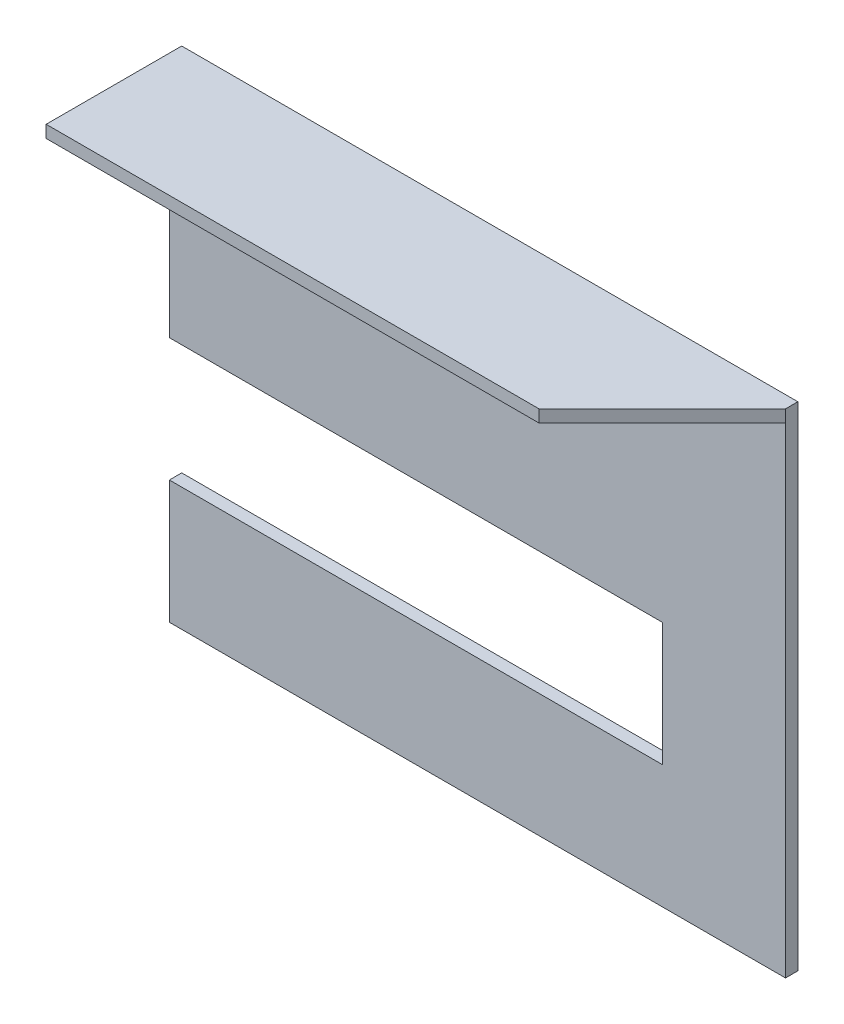
ISO-10303-21;
HEADER;
FILE_DESCRIPTION(('STEP AP214'),'2;1');
FILE_NAME('part.step','',(''),(''),'','','');
FILE_SCHEMA(('AUTOMOTIVE_DESIGN { 1 0 10303 214 1 1 1 1 }'));
ENDSEC;
DATA;
#1=APPLICATION_CONTEXT('core data for automotive mechanical design processes');
#2=APPLICATION_PROTOCOL_DEFINITION('international standard','automotive_design',2000,#1);
#3=PRODUCT_CONTEXT('',#1,'mechanical');
#4=PRODUCT('Part','Part','',(#3));
#5=PRODUCT_RELATED_PRODUCT_CATEGORY('part','',(#4));
#6=PRODUCT_DEFINITION_FORMATION('','',#4);
#7=PRODUCT_DEFINITION_CONTEXT('part definition',#1,'design');
#8=PRODUCT_DEFINITION('design','',#6,#7);
#9=PRODUCT_DEFINITION_SHAPE('','',#8);
#10=(LENGTH_UNIT() NAMED_UNIT(*) SI_UNIT(.MILLI.,.METRE.));
#11=(NAMED_UNIT(*) PLANE_ANGLE_UNIT() SI_UNIT($,.RADIAN.));
#12=(NAMED_UNIT(*) SI_UNIT($,.STERADIAN.) SOLID_ANGLE_UNIT());
#13=UNCERTAINTY_MEASURE_WITH_UNIT(LENGTH_MEASURE(1.E-05),#10,'distance_accuracy_value','');
#14=(GEOMETRIC_REPRESENTATION_CONTEXT(3) GLOBAL_UNCERTAINTY_ASSIGNED_CONTEXT((#13)) GLOBAL_UNIT_ASSIGNED_CONTEXT((#10,
#11,#12)) REPRESENTATION_CONTEXT('',''));
#15=CARTESIAN_POINT('',(0.,0.,0.));
#16=DIRECTION('',(0.,0.,1.));
#17=DIRECTION('',(1.,0.,0.));
#18=AXIS2_PLACEMENT_3D('',#15,#16,#17);
#19=CARTESIAN_POINT('',(-26.5032099718416,9.39871601126336,1.));
#20=DIRECTION('',(0.,-1.,0.));
#21=DIRECTION('',(1.,0.,0.));
#22=AXIS2_PLACEMENT_3D('',#19,#20,#21);
#23=PLANE('',#22);
#24=DIRECTION('',(-1.,0.,0.));
#25=VECTOR('',#24,1.);
#26=CARTESIAN_POINT('',(-26.5032099718416,9.39871601126336,11.));
#27=LINE('',#26,#25);
#28=CARTESIAN_POINT('',(13.4967900281584,9.39871601126336,11.));
#29=VERTEX_POINT('',#28);
#30=CARTESIAN_POINT('',(-26.5032099718416,9.39871601126336,11.));
#31=VERTEX_POINT('',#30);
#32=EDGE_CURVE('E123',#29,#31,#27,.T.);
#33=ORIENTED_EDGE('',*,*,#32,.F.);
#34=DIRECTION('',(-0.707106781186546,0.,0.707106781186549));
#35=VECTOR('',#34,1.);
#36=CARTESIAN_POINT('',(13.4967900281584,9.39871601126336,11.));
#37=LINE('',#36,#35);
#38=CARTESIAN_POINT('',(23.4967900281584,9.39871601126335,0.999999999999978));
#39=VERTEX_POINT('',#38);
#40=EDGE_CURVE('E51',#29,#39,#37,.F.);
#41=ORIENTED_EDGE('',*,*,#40,.T.);
#42=DIRECTION('',(0.,0.,-1.));
#43=VECTOR('',#42,1.);
#44=CARTESIAN_POINT('',(23.4967900281584,9.39871601126335,1.));
#45=LINE('',#44,#43);
#46=CARTESIAN_POINT('',(23.4967900281584,9.39871601126335,0.));
#47=VERTEX_POINT('',#46);
#48=EDGE_CURVE('E150',#39,#47,#45,.T.);
#49=ORIENTED_EDGE('',*,*,#48,.T.);
#50=DIRECTION('',(-1.,0.,0.));
#51=VECTOR('',#50,1.);
#52=CARTESIAN_POINT('',(-26.5032099718416,9.39871601126336,0.));
#53=LINE('',#52,#51);
#54=CARTESIAN_POINT('',(-26.5032099718416,9.39871601126336,0.));
#55=VERTEX_POINT('',#54);
#56=EDGE_CURVE('E137',#47,#55,#53,.T.);
#57=ORIENTED_EDGE('',*,*,#56,.T.);
#58=DIRECTION('',(0.,0.,-1.));
#59=VECTOR('',#58,1.);
#60=CARTESIAN_POINT('',(-26.5032099718416,9.39871601126336,1.));
#61=LINE('',#60,#59);
#62=EDGE_CURVE('E168',#31,#55,#61,.T.);
#63=ORIENTED_EDGE('',*,*,#62,.F.);
#64=EDGE_LOOP('',(#33,#41,#49,#57,#63));
#65=FACE_BOUND('',#64,.T.);
#66=ADVANCED_FACE('F35',(#65),#23,.F.);
#67=CARTESIAN_POINT('',(-26.5032099718416,9.39871601126336,1.));
#68=DIRECTION('',(1.,0.,0.));
#69=DIRECTION('',(0.,1.,0.));
#70=AXIS2_PLACEMENT_3D('',#67,#68,#69);
#71=PLANE('',#70);
#72=DIRECTION('',(0.,-1.,0.));
#73=VECTOR('',#72,1.);
#74=CARTESIAN_POINT('',(-26.5032099718416,9.39871601126336,0.));
#75=LINE('',#74,#73);
#76=CARTESIAN_POINT('',(-26.5032099718416,-10.6012839887366,0.));
#77=VERTEX_POINT('',#76);
#78=EDGE_CURVE('E139',#55,#77,#75,.T.);
#79=ORIENTED_EDGE('',*,*,#78,.T.);
#80=DIRECTION('',(0.,0.,-1.));
#81=VECTOR('',#80,1.);
#82=CARTESIAN_POINT('',(-26.5032099718416,-10.6012839887366,1.));
#83=LINE('',#82,#81);
#84=CARTESIAN_POINT('',(-26.5032099718416,-10.6012839887366,1.));
#85=VERTEX_POINT('',#84);
#86=EDGE_CURVE('E171',#85,#77,#83,.T.);
#87=ORIENTED_EDGE('',*,*,#86,.F.);
#88=DIRECTION('',(0.,-1.,0.));
#89=VECTOR('',#88,1.);
#90=CARTESIAN_POINT('',(-26.5032099718416,9.39871601126336,1.));
#91=LINE('',#90,#89);
#92=CARTESIAN_POINT('',(-26.5032099718416,8.39871601126335,1.));
#93=VERTEX_POINT('',#92);
#94=EDGE_CURVE('E136',#93,#85,#91,.T.);
#95=ORIENTED_EDGE('',*,*,#94,.F.);
#96=DIRECTION('',(0.,0.,-1.));
#97=VECTOR('',#96,1.);
#98=CARTESIAN_POINT('',(-26.5032099718416,8.39871601126335,11.));
#99=LINE('',#98,#97);
#100=CARTESIAN_POINT('',(-26.5032099718416,8.39871601126335,11.));
#101=VERTEX_POINT('',#100);
#102=EDGE_CURVE('E120',#101,#93,#99,.T.);
#103=ORIENTED_EDGE('',*,*,#102,.F.);
#104=DIRECTION('',(0.,-1.,0.));
#105=VECTOR('',#104,1.);
#106=CARTESIAN_POINT('',(-26.5032099718416,8.39871601126335,11.));
#107=LINE('',#106,#105);
#108=EDGE_CURVE('E124',#31,#101,#107,.T.);
#109=ORIENTED_EDGE('',*,*,#108,.F.);
#110=ORIENTED_EDGE('',*,*,#62,.T.);
#111=EDGE_LOOP('',(#79,#87,#95,#103,#109,#110));
#112=FACE_BOUND('',#111,.T.);
#113=ADVANCED_FACE('F134',(#112),#71,.F.);
#114=CARTESIAN_POINT('',(-26.5032099718416,-10.6012839887366,1.));
#115=DIRECTION('',(0.,1.,0.));
#116=DIRECTION('',(0.,0.,1.));
#117=AXIS2_PLACEMENT_3D('',#114,#115,#116);
#118=PLANE('',#117);
#119=DIRECTION('',(1.,0.,0.));
#120=VECTOR('',#119,1.);
#121=CARTESIAN_POINT('',(-26.5032099718416,-10.6012839887366,0.));
#122=LINE('',#121,#120);
#123=CARTESIAN_POINT('',(13.4967900281584,-10.6012839887366,0.));
#124=VERTEX_POINT('',#123);
#125=EDGE_CURVE('E195',#77,#124,#122,.T.);
#126=ORIENTED_EDGE('',*,*,#125,.T.);
#127=DIRECTION('',(0.,0.,-1.));
#128=VECTOR('',#127,1.);
#129=CARTESIAN_POINT('',(13.4967900281584,-10.6012839887366,1.));
#130=LINE('',#129,#128);
#131=CARTESIAN_POINT('',(13.4967900281584,-10.6012839887366,1.));
#132=VERTEX_POINT('',#131);
#133=EDGE_CURVE('E175',#132,#124,#130,.T.);
#134=ORIENTED_EDGE('',*,*,#133,.F.);
#135=DIRECTION('',(1.,0.,0.));
#136=VECTOR('',#135,1.);
#137=CARTESIAN_POINT('',(-26.5032099718416,-10.6012839887366,1.));
#138=LINE('',#137,#136);
#139=EDGE_CURVE('E184',#85,#132,#138,.T.);
#140=ORIENTED_EDGE('',*,*,#139,.F.);
#141=ORIENTED_EDGE('',*,*,#86,.T.);
#142=EDGE_LOOP('',(#126,#134,#140,#141));
#143=FACE_BOUND('',#142,.T.);
#144=ADVANCED_FACE('F239',(#143),#118,.F.);
#145=CARTESIAN_POINT('',(13.4967900281584,-10.6012839887366,1.));
#146=DIRECTION('',(1.,0.,0.));
#147=DIRECTION('',(0.,1.,0.));
#148=AXIS2_PLACEMENT_3D('',#145,#146,#147);
#149=PLANE('',#148);
#150=DIRECTION('',(0.,-1.,0.));
#151=VECTOR('',#150,1.);
#152=CARTESIAN_POINT('',(13.4967900281584,-10.6012839887366,0.));
#153=LINE('',#152,#151);
#154=CARTESIAN_POINT('',(13.4967900281584,-20.6012839887366,0.));
#155=VERTEX_POINT('',#154);
#156=EDGE_CURVE('E197',#124,#155,#153,.T.);
#157=ORIENTED_EDGE('',*,*,#156,.T.);
#158=DIRECTION('',(0.,0.,-1.));
#159=VECTOR('',#158,1.);
#160=CARTESIAN_POINT('',(13.4967900281584,-20.6012839887366,1.));
#161=LINE('',#160,#159);
#162=CARTESIAN_POINT('',(13.4967900281584,-20.6012839887366,1.));
#163=VERTEX_POINT('',#162);
#164=EDGE_CURVE('E214',#163,#155,#161,.T.);
#165=ORIENTED_EDGE('',*,*,#164,.F.);
#166=DIRECTION('',(0.,-1.,0.));
#167=VECTOR('',#166,1.);
#168=CARTESIAN_POINT('',(13.4967900281584,-10.6012839887366,1.));
#169=LINE('',#168,#167);
#170=EDGE_CURVE('E186',#132,#163,#169,.T.);
#171=ORIENTED_EDGE('',*,*,#170,.F.);
#172=ORIENTED_EDGE('',*,*,#133,.T.);
#173=EDGE_LOOP('',(#157,#165,#171,#172));
#174=FACE_BOUND('',#173,.T.);
#175=ADVANCED_FACE('F221',(#174),#149,.F.);
#176=CARTESIAN_POINT('',(13.4967900281584,-20.6012839887366,1.));
#177=DIRECTION('',(0.,-1.,0.));
#178=DIRECTION('',(1.,0.,0.));
#179=AXIS2_PLACEMENT_3D('',#176,#177,#178);
#180=PLANE('',#179);
#181=DIRECTION('',(-1.,0.,0.));
#182=VECTOR('',#181,1.);
#183=CARTESIAN_POINT('',(13.4967900281584,-20.6012839887366,0.));
#184=LINE('',#183,#182);
#185=CARTESIAN_POINT('',(-26.5032099718416,-20.6012839887366,0.));
#186=VERTEX_POINT('',#185);
#187=EDGE_CURVE('E199',#155,#186,#184,.T.);
#188=ORIENTED_EDGE('',*,*,#187,.T.);
#189=DIRECTION('',(0.,0.,-1.));
#190=VECTOR('',#189,1.);
#191=CARTESIAN_POINT('',(-26.5032099718416,-20.6012839887366,1.));
#192=LINE('',#191,#190);
#193=CARTESIAN_POINT('',(-26.5032099718416,-20.6012839887366,1.));
#194=VERTEX_POINT('',#193);
#195=EDGE_CURVE('E211',#194,#186,#192,.T.);
#196=ORIENTED_EDGE('',*,*,#195,.F.);
#197=DIRECTION('',(-1.,0.,0.));
#198=VECTOR('',#197,1.);
#199=CARTESIAN_POINT('',(13.4967900281584,-20.6012839887366,1.));
#200=LINE('',#199,#198);
#201=EDGE_CURVE('E188',#163,#194,#200,.T.);
#202=ORIENTED_EDGE('',*,*,#201,.F.);
#203=ORIENTED_EDGE('',*,*,#164,.T.);
#204=EDGE_LOOP('',(#188,#196,#202,#203));
#205=FACE_BOUND('',#204,.T.);
#206=ADVANCED_FACE('F233',(#205),#180,.F.);
#207=CARTESIAN_POINT('',(-26.5032099718416,-20.6012839887366,1.));
#208=DIRECTION('',(1.,0.,0.));
#209=DIRECTION('',(0.,0.,-1.));
#210=AXIS2_PLACEMENT_3D('',#207,#208,#209);
#211=PLANE('',#210);
#212=DIRECTION('',(0.,-1.,0.));
#213=VECTOR('',#212,1.);
#214=CARTESIAN_POINT('',(-26.5032099718416,-20.6012839887366,0.));
#215=LINE('',#214,#213);
#216=CARTESIAN_POINT('',(-26.5032099718416,-30.6012839887366,0.));
#217=VERTEX_POINT('',#216);
#218=EDGE_CURVE('E201',#186,#217,#215,.T.);
#219=ORIENTED_EDGE('',*,*,#218,.T.);
#220=DIRECTION('',(0.,0.,-1.));
#221=VECTOR('',#220,1.);
#222=CARTESIAN_POINT('',(-26.5032099718416,-30.6012839887366,1.));
#223=LINE('',#222,#221);
#224=CARTESIAN_POINT('',(-26.5032099718416,-30.6012839887366,1.));
#225=VERTEX_POINT('',#224);
#226=EDGE_CURVE('E208',#225,#217,#223,.T.);
#227=ORIENTED_EDGE('',*,*,#226,.F.);
#228=DIRECTION('',(0.,-1.,0.));
#229=VECTOR('',#228,1.);
#230=CARTESIAN_POINT('',(-26.5032099718416,-20.6012839887366,1.));
#231=LINE('',#230,#229);
#232=EDGE_CURVE('E190',#194,#225,#231,.T.);
#233=ORIENTED_EDGE('',*,*,#232,.F.);
#234=ORIENTED_EDGE('',*,*,#195,.T.);
#235=EDGE_LOOP('',(#219,#227,#233,#234));
#236=FACE_BOUND('',#235,.T.);
#237=ADVANCED_FACE('F237',(#236),#211,.F.);
#238=CARTESIAN_POINT('',(-26.5032099718416,-30.6012839887366,1.));
#239=DIRECTION('',(0.,1.,0.));
#240=DIRECTION('',(0.,0.,1.));
#241=AXIS2_PLACEMENT_3D('',#238,#239,#240);
#242=PLANE('',#241);
#243=DIRECTION('',(1.,0.,0.));
#244=VECTOR('',#243,1.);
#245=CARTESIAN_POINT('',(-26.5032099718416,-30.6012839887366,0.));
#246=LINE('',#245,#244);
#247=CARTESIAN_POINT('',(23.4967900281584,-30.6012839887366,0.));
#248=VERTEX_POINT('',#247);
#249=EDGE_CURVE('E203',#217,#248,#246,.T.);
#250=ORIENTED_EDGE('',*,*,#249,.T.);
#251=DIRECTION('',(0.,0.,-1.));
#252=VECTOR('',#251,1.);
#253=CARTESIAN_POINT('',(23.4967900281584,-30.6012839887366,1.));
#254=LINE('',#253,#252);
#255=CARTESIAN_POINT('',(23.4967900281584,-30.6012839887366,1.));
#256=VERTEX_POINT('',#255);
#257=EDGE_CURVE('E192',#256,#248,#254,.T.);
#258=ORIENTED_EDGE('',*,*,#257,.F.);
#259=DIRECTION('',(1.,0.,0.));
#260=VECTOR('',#259,1.);
#261=CARTESIAN_POINT('',(-26.5032099718416,-30.6012839887366,1.));
#262=LINE('',#261,#260);
#263=EDGE_CURVE('E164',#225,#256,#262,.T.);
#264=ORIENTED_EDGE('',*,*,#263,.F.);
#265=ORIENTED_EDGE('',*,*,#226,.T.);
#266=EDGE_LOOP('',(#250,#258,#264,#265));
#267=FACE_BOUND('',#266,.T.);
#268=ADVANCED_FACE('F241',(#267),#242,.F.);
#269=CARTESIAN_POINT('',(23.4967900281584,-8.33256261734247,1.));
#270=DIRECTION('',(-1.,0.,0.));
#271=DIRECTION('',(0.,-1.,0.));
#272=AXIS2_PLACEMENT_3D('',#269,#270,#271);
#273=PLANE('',#272);
#274=ORIENTED_EDGE('',*,*,#48,.F.);
#275=DIRECTION('',(0.,-1.,0.));
#276=VECTOR('',#275,1.);
#277=CARTESIAN_POINT('',(23.4967900281584,-8.33256261734247,0.999999999999978));
#278=LINE('',#277,#276);
#279=CARTESIAN_POINT('',(23.4967900281584,8.39871601126335,1.));
#280=VERTEX_POINT('',#279);
#281=EDGE_CURVE('E44',#39,#280,#278,.T.);
#282=ORIENTED_EDGE('',*,*,#281,.T.);
#283=DIRECTION('',(0.,1.,0.));
#284=VECTOR('',#283,1.);
#285=CARTESIAN_POINT('',(23.4967900281584,9.39871601126335,1.));
#286=LINE('',#285,#284);
#287=EDGE_CURVE('E158',#256,#280,#286,.T.);
#288=ORIENTED_EDGE('',*,*,#287,.F.);
#289=ORIENTED_EDGE('',*,*,#257,.T.);
#290=DIRECTION('',(0.,1.,0.));
#291=VECTOR('',#290,1.);
#292=CARTESIAN_POINT('',(23.4967900281584,-8.33256261734247,0.));
#293=LINE('',#292,#291);
#294=EDGE_CURVE('E166',#248,#47,#293,.T.);
#295=ORIENTED_EDGE('',*,*,#294,.T.);
#296=EDGE_LOOP('',(#274,#282,#288,#289,#295));
#297=FACE_BOUND('',#296,.T.);
#298=ADVANCED_FACE('F156',(#297),#273,.F.);
#299=CARTESIAN_POINT('',(0.,0.,1.));
#300=DIRECTION('',(0.,0.,1.));
#301=DIRECTION('',(1.,0.,0.));
#302=AXIS2_PLACEMENT_3D('',#299,#300,#301);
#303=PLANE('',#302);
#304=DIRECTION('',(1.,0.,0.));
#305=VECTOR('',#304,1.);
#306=CARTESIAN_POINT('',(23.4967900281584,8.39871601126335,1.));
#307=LINE('',#306,#305);
#308=EDGE_CURVE('E131',#93,#280,#307,.T.);
#309=ORIENTED_EDGE('',*,*,#308,.F.);
#310=ORIENTED_EDGE('',*,*,#94,.T.);
#311=ORIENTED_EDGE('',*,*,#139,.T.);
#312=ORIENTED_EDGE('',*,*,#170,.T.);
#313=ORIENTED_EDGE('',*,*,#201,.T.);
#314=ORIENTED_EDGE('',*,*,#232,.T.);
#315=ORIENTED_EDGE('',*,*,#263,.T.);
#316=ORIENTED_EDGE('',*,*,#287,.T.);
#317=EDGE_LOOP('',(#309,#310,#311,#312,#313,#314,#315,#316));
#318=FACE_BOUND('',#317,.T.);
#319=ADVANCED_FACE('F162',(#318),#303,.T.);
#320=CARTESIAN_POINT('',(0.,0.,0.));
#321=DIRECTION('',(0.,0.,1.));
#322=DIRECTION('',(1.,0.,0.));
#323=AXIS2_PLACEMENT_3D('',#320,#321,#322);
#324=PLANE('',#323);
#325=ORIENTED_EDGE('',*,*,#56,.F.);
#326=ORIENTED_EDGE('',*,*,#294,.F.);
#327=ORIENTED_EDGE('',*,*,#249,.F.);
#328=ORIENTED_EDGE('',*,*,#218,.F.);
#329=ORIENTED_EDGE('',*,*,#187,.F.);
#330=ORIENTED_EDGE('',*,*,#156,.F.);
#331=ORIENTED_EDGE('',*,*,#125,.F.);
#332=ORIENTED_EDGE('',*,*,#78,.F.);
#333=EDGE_LOOP('',(#325,#326,#327,#328,#329,#330,#331,#332));
#334=FACE_BOUND('',#333,.T.);
#335=ADVANCED_FACE('F228',(#334),#324,.F.);
#336=CARTESIAN_POINT('',(23.4967900281584,8.39871601126335,11.));
#337=DIRECTION('',(0.,1.,0.));
#338=DIRECTION('',(0.,0.,1.));
#339=AXIS2_PLACEMENT_3D('',#336,#337,#338);
#340=PLANE('',#339);
#341=ORIENTED_EDGE('',*,*,#308,.T.);
#342=DIRECTION('',(0.707106781186546,0.,-0.707106781186549));
#343=VECTOR('',#342,1.);
#344=CARTESIAN_POINT('',(13.4967900281584,8.39871601126335,11.));
#345=LINE('',#344,#343);
#346=CARTESIAN_POINT('',(13.4967900281584,8.39871601126335,11.));
#347=VERTEX_POINT('',#346);
#348=EDGE_CURVE('E11',#280,#347,#345,.F.);
#349=ORIENTED_EDGE('',*,*,#348,.T.);
#350=DIRECTION('',(1.,0.,0.));
#351=VECTOR('',#350,1.);
#352=CARTESIAN_POINT('',(23.4967900281584,8.39871601126335,11.));
#353=LINE('',#352,#351);
#354=EDGE_CURVE('E115',#101,#347,#353,.T.);
#355=ORIENTED_EDGE('',*,*,#354,.F.);
#356=ORIENTED_EDGE('',*,*,#102,.T.);
#357=EDGE_LOOP('',(#341,#349,#355,#356));
#358=FACE_BOUND('',#357,.T.);
#359=ADVANCED_FACE('F118',(#358),#340,.F.);
#360=CARTESIAN_POINT('',(0.,0.,11.));
#361=DIRECTION('',(0.,0.,-1.));
#362=DIRECTION('',(-1.,0.,0.));
#363=AXIS2_PLACEMENT_3D('',#360,#361,#362);
#364=PLANE('',#363);
#365=ORIENTED_EDGE('',*,*,#354,.T.);
#366=DIRECTION('',(0.,1.,0.));
#367=VECTOR('',#366,1.);
#368=CARTESIAN_POINT('',(13.4967900281584,0.,11.));
#369=LINE('',#368,#367);
#370=EDGE_CURVE('E148',#347,#29,#369,.T.);
#371=ORIENTED_EDGE('',*,*,#370,.T.);
#372=ORIENTED_EDGE('',*,*,#32,.T.);
#373=ORIENTED_EDGE('',*,*,#108,.T.);
#374=EDGE_LOOP('',(#365,#371,#372,#373));
#375=FACE_BOUND('',#374,.T.);
#376=ADVANCED_FACE('F127',(#375),#364,.F.);
#377=CARTESIAN_POINT('',(13.4967900281584,0.,11.));
#378=DIRECTION('',(-0.707106781186549,0.,-0.707106781186546));
#379=DIRECTION('',(0.,1.,0.));
#380=AXIS2_PLACEMENT_3D('',#377,#378,#379);
#381=PLANE('',#380);
#382=ORIENTED_EDGE('',*,*,#348,.F.);
#383=ORIENTED_EDGE('',*,*,#281,.F.);
#384=ORIENTED_EDGE('',*,*,#40,.F.);
#385=ORIENTED_EDGE('',*,*,#370,.F.);
#386=EDGE_LOOP('',(#382,#383,#384,#385));
#387=FACE_BOUND('',#386,.T.);
#388=ADVANCED_FACE('F37',(#387),#381,.F.);
#389=CLOSED_SHELL('',(#66,#113,#144,#175,#206,#237,#268,#298,#319,#335,#359,#376,#388));
#390=MANIFOLD_SOLID_BREP('B2',#389);
#391=ADVANCED_BREP_SHAPE_REPRESENTATION('',(#18,#390),#14);
#392=SHAPE_DEFINITION_REPRESENTATION(#9,#391);
ENDSEC;
END-ISO-10303-21;
